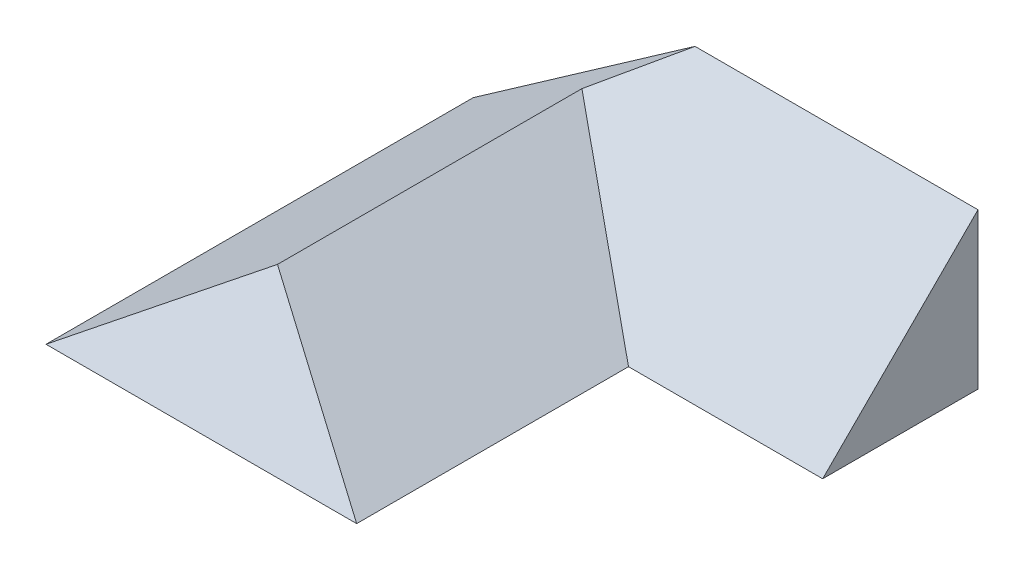
ISO-10303-21;
HEADER;
FILE_DESCRIPTION(('STEP AP214'),'2;1');
FILE_NAME('part.step','',(''),(''),'','','');
FILE_SCHEMA(('AUTOMOTIVE_DESIGN { 1 0 10303 214 1 1 1 1 }'));
ENDSEC;
DATA;
#1=APPLICATION_CONTEXT('core data for automotive mechanical design processes');
#2=APPLICATION_PROTOCOL_DEFINITION('international standard','automotive_design',2000,#1);
#3=PRODUCT_CONTEXT('',#1,'mechanical');
#4=PRODUCT('Part','Part','',(#3));
#5=PRODUCT_RELATED_PRODUCT_CATEGORY('part','',(#4));
#6=PRODUCT_DEFINITION_FORMATION('','',#4);
#7=PRODUCT_DEFINITION_CONTEXT('part definition',#1,'design');
#8=PRODUCT_DEFINITION('design','',#6,#7);
#9=PRODUCT_DEFINITION_SHAPE('','',#8);
#10=(LENGTH_UNIT() NAMED_UNIT(*) SI_UNIT(.MILLI.,.METRE.));
#11=(NAMED_UNIT(*) PLANE_ANGLE_UNIT() SI_UNIT($,.RADIAN.));
#12=(NAMED_UNIT(*) SI_UNIT($,.STERADIAN.) SOLID_ANGLE_UNIT());
#13=UNCERTAINTY_MEASURE_WITH_UNIT(LENGTH_MEASURE(1.E-05),#10,'distance_accuracy_value','');
#14=(GEOMETRIC_REPRESENTATION_CONTEXT(3) GLOBAL_UNCERTAINTY_ASSIGNED_CONTEXT((#13)) GLOBAL_UNIT_ASSIGNED_CONTEXT((#10,
#11,#12)) REPRESENTATION_CONTEXT('',''));
#15=CARTESIAN_POINT('',(0.,0.,0.));
#16=DIRECTION('',(0.,0.,1.));
#17=DIRECTION('',(1.,0.,0.));
#18=AXIS2_PLACEMENT_3D('',#15,#16,#17);
#19=CARTESIAN_POINT('',(40.,28.0083015283881,-110.));
#20=DIRECTION('',(0.,0.,1.));
#21=DIRECTION('',(1.,0.,0.));
#22=AXIS2_PLACEMENT_3D('',#19,#20,#21);
#23=PLANE('',#22);
#24=DIRECTION('',(-0.819152044288995,-0.573576436351041,0.));
#25=VECTOR('',#24,1.);
#26=CARTESIAN_POINT('',(0.,0.,-110.));
#27=LINE('',#26,#25);
#28=CARTESIAN_POINT('',(57.1259202696847,39.9999999999996,-110.));
#29=VERTEX_POINT('',#28);
#30=CARTESIAN_POINT('',(0.,0.,-110.));
#31=VERTEX_POINT('',#30);
#32=EDGE_CURVE('E77',#29,#31,#27,.T.);
#33=ORIENTED_EDGE('',*,*,#32,.F.);
#34=DIRECTION('',(1.,0.,0.));
#35=VECTOR('',#34,1.);
#36=CARTESIAN_POINT('',(40.,39.9999999999996,-110.));
#37=LINE('',#36,#35);
#38=CARTESIAN_POINT('',(130.,39.9999999999996,-110.));
#39=VERTEX_POINT('',#38);
#40=EDGE_CURVE('E81',#29,#39,#37,.T.);
#41=ORIENTED_EDGE('',*,*,#40,.T.);
#42=DIRECTION('',(0.,1.,0.));
#43=VECTOR('',#42,1.);
#44=CARTESIAN_POINT('',(130.,0.,-110.));
#45=LINE('',#44,#43);
#46=CARTESIAN_POINT('',(130.,0.,-110.));
#47=VERTEX_POINT('',#46);
#48=EDGE_CURVE('E91',#47,#39,#45,.T.);
#49=ORIENTED_EDGE('',*,*,#48,.F.);
#50=DIRECTION('',(1.,0.,0.));
#51=VECTOR('',#50,1.);
#52=CARTESIAN_POINT('',(0.,0.,-110.));
#53=LINE('',#52,#51);
#54=EDGE_CURVE('E83',#31,#47,#53,.T.);
#55=ORIENTED_EDGE('',*,*,#54,.F.);
#56=EDGE_LOOP('',(#33,#41,#49,#55));
#57=FACE_BOUND('',#56,.T.);
#58=ADVANCED_FACE('F31',(#57),#23,.F.);
#59=CARTESIAN_POINT('',(40.,0.,-70.));
#60=DIRECTION('',(0.,0.707106781186551,0.707106781186544));
#61=DIRECTION('',(0.,-0.707106781186544,0.707106781186551));
#62=AXIS2_PLACEMENT_3D('',#59,#60,#61);
#63=PLANE('',#62);
#64=ORIENTED_EDGE('',*,*,#40,.F.);
#65=DIRECTION('',(-0.710564775461632,-0.497542812164519,0.497542812164524));
#66=VECTOR('',#65,1.);
#67=CARTESIAN_POINT('',(20.1960920050736,14.1414558643292,-84.1414558643293));
#68=LINE('',#67,#66);
#69=CARTESIAN_POINT('',(40.,28.008301528388,-98.0083015283884));
#70=VERTEX_POINT('',#69);
#71=EDGE_CURVE('E88',#29,#70,#68,.T.);
#72=ORIENTED_EDGE('',*,*,#71,.T.);
#73=DIRECTION('',(0.710564775461632,-0.497542812164519,0.497542812164524));
#74=VECTOR('',#73,1.);
#75=CARTESIAN_POINT('',(65.8585441356706,9.9019539974632,-79.9019539974633));
#76=LINE('',#75,#74);
#77=CARTESIAN_POINT('',(80.,0.,-70.));
#78=VERTEX_POINT('',#77);
#79=EDGE_CURVE('E100',#70,#78,#76,.T.);
#80=ORIENTED_EDGE('',*,*,#79,.T.);
#81=DIRECTION('',(1.,0.,0.));
#82=VECTOR('',#81,1.);
#83=CARTESIAN_POINT('',(40.,0.,-70.));
#84=LINE('',#83,#82);
#85=CARTESIAN_POINT('',(130.,0.,-70.));
#86=VERTEX_POINT('',#85);
#87=EDGE_CURVE('E97',#78,#86,#84,.T.);
#88=ORIENTED_EDGE('',*,*,#87,.T.);
#89=DIRECTION('',(0.,-0.707106781186544,0.707106781186551));
#90=VECTOR('',#89,1.);
#91=CARTESIAN_POINT('',(130.,0.,-70.));
#92=LINE('',#91,#90);
#93=EDGE_CURVE('E95',#39,#86,#92,.T.);
#94=ORIENTED_EDGE('',*,*,#93,.F.);
#95=EDGE_LOOP('',(#64,#72,#80,#88,#94));
#96=FACE_BOUND('',#95,.T.);
#97=ADVANCED_FACE('F93',(#96),#63,.T.);
#98=CARTESIAN_POINT('',(0.,0.,-110.));
#99=DIRECTION('',(-0.573576436351041,0.819152044288995,0.));
#100=DIRECTION('',(-0.819152044288995,-0.573576436351041,0.));
#101=AXIS2_PLACEMENT_3D('',#98,#99,#100);
#102=PLANE('',#101);
#103=DIRECTION('',(0.,0.,1.));
#104=VECTOR('',#103,1.);
#105=CARTESIAN_POINT('',(0.,0.,-110.));
#106=LINE('',#105,#104);
#107=CARTESIAN_POINT('',(0.,0.,0.));
#108=VERTEX_POINT('',#107);
#109=EDGE_CURVE('E35',#31,#108,#106,.T.);
#110=ORIENTED_EDGE('',*,*,#109,.T.);
#111=DIRECTION('',(0.760137540724262,0.532254036091312,-0.372688288313677));
#112=VECTOR('',#111,1.);
#113=CARTESIAN_POINT('',(31.1623794829043,21.8201330224809,-15.2786216270796));
#114=LINE('',#113,#112);
#115=CARTESIAN_POINT('',(40.,28.008301528388,-19.6116238626277));
#116=VERTEX_POINT('',#115);
#117=EDGE_CURVE('E108',#108,#116,#114,.T.);
#118=ORIENTED_EDGE('',*,*,#117,.T.);
#119=DIRECTION('',(0.,0.,1.));
#120=VECTOR('',#119,1.);
#121=CARTESIAN_POINT('',(40.,28.0083015283881,-110.));
#122=LINE('',#121,#120);
#123=EDGE_CURVE('E11',#70,#116,#122,.T.);
#124=ORIENTED_EDGE('',*,*,#123,.F.);
#125=ORIENTED_EDGE('',*,*,#71,.F.);
#126=ORIENTED_EDGE('',*,*,#32,.T.);
#127=EDGE_LOOP('',(#110,#118,#124,#125,#126));
#128=FACE_BOUND('',#127,.T.);
#129=ADVANCED_FACE('F33',(#128),#102,.T.);
#130=CARTESIAN_POINT('',(80.,0.,-110.));
#131=DIRECTION('',(0.573576436351042,0.819152044288995,0.));
#132=DIRECTION('',(-0.819152044288995,0.573576436351042,0.));
#133=AXIS2_PLACEMENT_3D('',#130,#131,#132);
#134=PLANE('',#133);
#135=ORIENTED_EDGE('',*,*,#79,.F.);
#136=ORIENTED_EDGE('',*,*,#123,.T.);
#137=DIRECTION('',(0.760137540724262,-0.532254036091312,0.372688288313677));
#138=VECTOR('',#137,1.);
#139=CARTESIAN_POINT('',(48.8376205170957,21.8201330224809,-15.2786216270796));
#140=LINE('',#139,#138);
#141=CARTESIAN_POINT('',(80.,0.,0.));
#142=VERTEX_POINT('',#141);
#143=EDGE_CURVE('E106',#116,#142,#140,.T.);
#144=ORIENTED_EDGE('',*,*,#143,.T.);
#145=DIRECTION('',(0.,0.,1.));
#146=VECTOR('',#145,1.);
#147=CARTESIAN_POINT('',(80.,0.,-110.));
#148=LINE('',#147,#146);
#149=EDGE_CURVE('E40',#78,#142,#148,.T.);
#150=ORIENTED_EDGE('',*,*,#149,.F.);
#151=EDGE_LOOP('',(#135,#136,#144,#150));
#152=FACE_BOUND('',#151,.T.);
#153=ADVANCED_FACE('F120',(#152),#134,.T.);
#154=CARTESIAN_POINT('',(0.,0.,-110.));
#155=DIRECTION('',(0.,-1.,0.));
#156=DIRECTION('',(0.,0.,-1.));
#157=AXIS2_PLACEMENT_3D('',#154,#155,#156);
#158=PLANE('',#157);
#159=ORIENTED_EDGE('',*,*,#54,.T.);
#160=DIRECTION('',(0.,0.,-1.));
#161=VECTOR('',#160,1.);
#162=CARTESIAN_POINT('',(130.,0.,-110.));
#163=LINE('',#162,#161);
#164=EDGE_CURVE('E98',#86,#47,#163,.T.);
#165=ORIENTED_EDGE('',*,*,#164,.F.);
#166=ORIENTED_EDGE('',*,*,#87,.F.);
#167=ORIENTED_EDGE('',*,*,#149,.T.);
#168=DIRECTION('',(1.,0.,0.));
#169=VECTOR('',#168,1.);
#170=CARTESIAN_POINT('',(0.,0.,0.));
#171=LINE('',#170,#169);
#172=EDGE_CURVE('E85',#108,#142,#171,.T.);
#173=ORIENTED_EDGE('',*,*,#172,.F.);
#174=ORIENTED_EDGE('',*,*,#109,.F.);
#175=EDGE_LOOP('',(#159,#165,#166,#167,#173,#174));
#176=FACE_BOUND('',#175,.T.);
#177=ADVANCED_FACE('F117',(#176),#158,.T.);
#178=CARTESIAN_POINT('',(80.,0.,0.));
#179=DIRECTION('',(0.,0.573576436351043,0.819152044288994));
#180=DIRECTION('',(0.,-0.819152044288994,0.573576436351043));
#181=AXIS2_PLACEMENT_3D('',#178,#179,#180);
#182=PLANE('',#181);
#183=ORIENTED_EDGE('',*,*,#172,.T.);
#184=ORIENTED_EDGE('',*,*,#143,.F.);
#185=ORIENTED_EDGE('',*,*,#117,.F.);
#186=EDGE_LOOP('',(#183,#184,#185));
#187=FACE_BOUND('',#186,.T.);
#188=ADVANCED_FACE('F116',(#187),#182,.T.);
#189=CARTESIAN_POINT('',(130.,0.,-110.));
#190=DIRECTION('',(1.,0.,0.));
#191=DIRECTION('',(0.,0.,-1.));
#192=AXIS2_PLACEMENT_3D('',#189,#190,#191);
#193=PLANE('',#192);
#194=ORIENTED_EDGE('',*,*,#48,.T.);
#195=ORIENTED_EDGE('',*,*,#93,.T.);
#196=ORIENTED_EDGE('',*,*,#164,.T.);
#197=EDGE_LOOP('',(#194,#195,#196));
#198=FACE_BOUND('',#197,.T.);
#199=ADVANCED_FACE('F125',(#198),#193,.T.);
#200=CLOSED_SHELL('',(#58,#97,#129,#153,#177,#188,#199));
#201=MANIFOLD_SOLID_BREP('B2',#200);
#202=ADVANCED_BREP_SHAPE_REPRESENTATION('',(#18,#201),#14);
#203=SHAPE_DEFINITION_REPRESENTATION(#9,#202);
ENDSEC;
END-ISO-10303-21;
